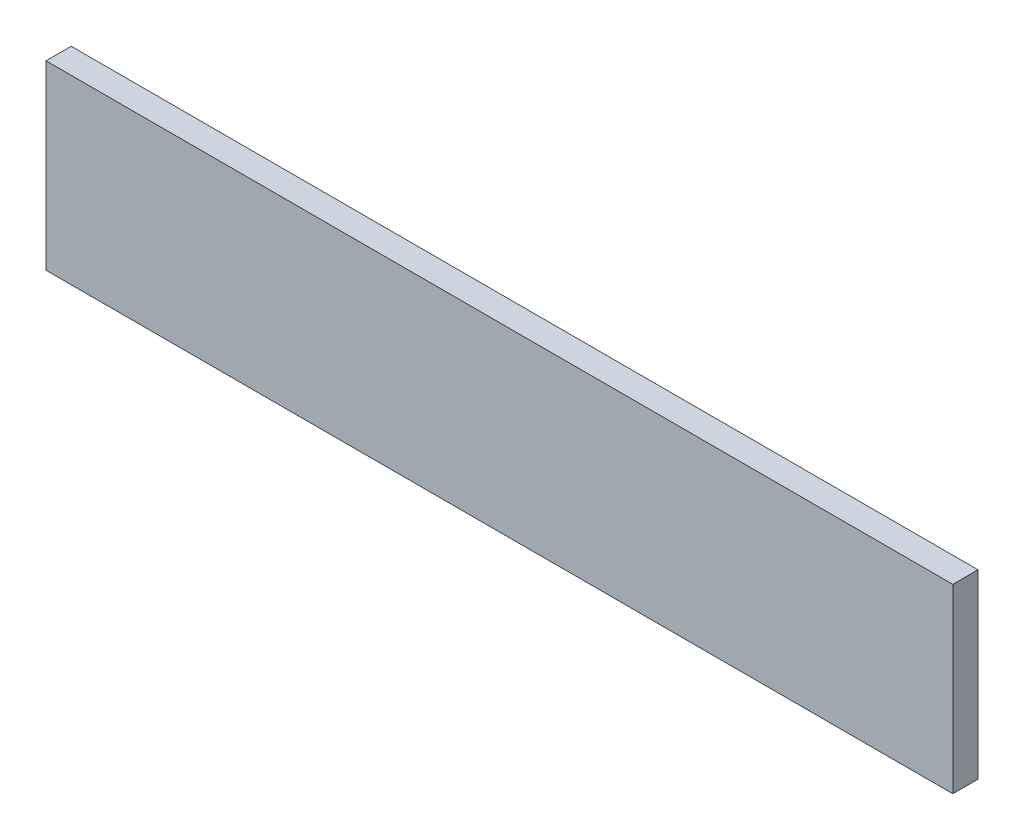
ISO-10303-21;
HEADER;
FILE_DESCRIPTION(('STEP AP214'),'2;1');
FILE_NAME('part.step','',(''),(''),'','','');
FILE_SCHEMA(('AUTOMOTIVE_DESIGN { 1 0 10303 214 1 1 1 1 }'));
ENDSEC;
DATA;
#1=APPLICATION_CONTEXT('core data for automotive mechanical design processes');
#2=APPLICATION_PROTOCOL_DEFINITION('international standard','automotive_design',2000,#1);
#3=PRODUCT_CONTEXT('',#1,'mechanical');
#4=PRODUCT('Part','Part','',(#3));
#5=PRODUCT_RELATED_PRODUCT_CATEGORY('part','',(#4));
#6=PRODUCT_DEFINITION_FORMATION('','',#4);
#7=PRODUCT_DEFINITION_CONTEXT('part definition',#1,'design');
#8=PRODUCT_DEFINITION('design','',#6,#7);
#9=PRODUCT_DEFINITION_SHAPE('','',#8);
#10=(LENGTH_UNIT() NAMED_UNIT(*) SI_UNIT(.MILLI.,.METRE.));
#11=(NAMED_UNIT(*) PLANE_ANGLE_UNIT() SI_UNIT($,.RADIAN.));
#12=(NAMED_UNIT(*) SI_UNIT($,.STERADIAN.) SOLID_ANGLE_UNIT());
#13=UNCERTAINTY_MEASURE_WITH_UNIT(LENGTH_MEASURE(1.E-05),#10,'distance_accuracy_value','');
#14=(GEOMETRIC_REPRESENTATION_CONTEXT(3) GLOBAL_UNCERTAINTY_ASSIGNED_CONTEXT((#13)) GLOBAL_UNIT_ASSIGNED_CONTEXT((#10,
#11,#12)) REPRESENTATION_CONTEXT('',''));
#15=CARTESIAN_POINT('',(0.,0.,0.));
#16=DIRECTION('',(0.,0.,1.));
#17=DIRECTION('',(1.,0.,0.));
#18=AXIS2_PLACEMENT_3D('',#15,#16,#17);
#19=CARTESIAN_POINT('',(57.15,-11.43,1.5875));
#20=DIRECTION('',(-1.,0.,0.));
#21=DIRECTION('',(0.,0.,1.));
#22=AXIS2_PLACEMENT_3D('',#19,#20,#21);
#23=PLANE('',#22);
#24=DIRECTION('',(0.,1.,0.));
#25=VECTOR('',#24,1.);
#26=CARTESIAN_POINT('',(57.15,-11.43,-1.5875));
#27=LINE('',#26,#25);
#28=CARTESIAN_POINT('',(57.15,-11.43,-1.5875));
#29=VERTEX_POINT('',#28);
#30=CARTESIAN_POINT('',(57.15,11.43,-1.5875));
#31=VERTEX_POINT('',#30);
#32=EDGE_CURVE('E107',#29,#31,#27,.T.);
#33=ORIENTED_EDGE('',*,*,#32,.T.);
#34=DIRECTION('',(0.,0.,-1.));
#35=VECTOR('',#34,1.);
#36=CARTESIAN_POINT('',(57.15,11.43,1.5875));
#37=LINE('',#36,#35);
#38=CARTESIAN_POINT('',(57.15,11.43,1.5875));
#39=VERTEX_POINT('',#38);
#40=EDGE_CURVE('E11',#39,#31,#37,.T.);
#41=ORIENTED_EDGE('',*,*,#40,.F.);
#42=DIRECTION('',(0.,1.,0.));
#43=VECTOR('',#42,1.);
#44=CARTESIAN_POINT('',(57.15,-11.43,1.5875));
#45=LINE('',#44,#43);
#46=CARTESIAN_POINT('',(57.15,-11.43,1.5875));
#47=VERTEX_POINT('',#46);
#48=EDGE_CURVE('E91',#47,#39,#45,.T.);
#49=ORIENTED_EDGE('',*,*,#48,.F.);
#50=DIRECTION('',(0.,0.,-1.));
#51=VECTOR('',#50,1.);
#52=CARTESIAN_POINT('',(57.15,-11.43,1.5875));
#53=LINE('',#52,#51);
#54=EDGE_CURVE('E103',#47,#29,#53,.T.);
#55=ORIENTED_EDGE('',*,*,#54,.T.);
#56=EDGE_LOOP('',(#33,#41,#49,#55));
#57=FACE_BOUND('',#56,.T.);
#58=ADVANCED_FACE('F39',(#57),#23,.F.);
#59=CARTESIAN_POINT('',(-57.15,11.43,1.5875));
#60=DIRECTION('',(0.,-1.,0.));
#61=DIRECTION('',(0.,0.,-1.));
#62=AXIS2_PLACEMENT_3D('',#59,#60,#61);
#63=PLANE('',#62);
#64=DIRECTION('',(-1.,0.,0.));
#65=VECTOR('',#64,1.);
#66=CARTESIAN_POINT('',(-57.15,11.43,-1.5875));
#67=LINE('',#66,#65);
#68=CARTESIAN_POINT('',(-57.15,11.43,-1.5875));
#69=VERTEX_POINT('',#68);
#70=EDGE_CURVE('E96',#31,#69,#67,.T.);
#71=ORIENTED_EDGE('',*,*,#70,.T.);
#72=DIRECTION('',(0.,0.,-1.));
#73=VECTOR('',#72,1.);
#74=CARTESIAN_POINT('',(-57.15,11.43,1.5875));
#75=LINE('',#74,#73);
#76=CARTESIAN_POINT('',(-57.15,11.43,1.5875));
#77=VERTEX_POINT('',#76);
#78=EDGE_CURVE('E48',#77,#69,#75,.T.);
#79=ORIENTED_EDGE('',*,*,#78,.F.);
#80=DIRECTION('',(-1.,0.,0.));
#81=VECTOR('',#80,1.);
#82=CARTESIAN_POINT('',(-57.15,11.43,1.5875));
#83=LINE('',#82,#81);
#84=EDGE_CURVE('E86',#39,#77,#83,.T.);
#85=ORIENTED_EDGE('',*,*,#84,.F.);
#86=ORIENTED_EDGE('',*,*,#40,.T.);
#87=EDGE_LOOP('',(#71,#79,#85,#86));
#88=FACE_BOUND('',#87,.T.);
#89=ADVANCED_FACE('F95',(#88),#63,.F.);
#90=CARTESIAN_POINT('',(-57.15,-11.43,1.5875));
#91=DIRECTION('',(1.,0.,0.));
#92=DIRECTION('',(0.,0.,-1.));
#93=AXIS2_PLACEMENT_3D('',#90,#91,#92);
#94=PLANE('',#93);
#95=DIRECTION('',(0.,-1.,0.));
#96=VECTOR('',#95,1.);
#97=CARTESIAN_POINT('',(-57.15,-11.43,-1.5875));
#98=LINE('',#97,#96);
#99=CARTESIAN_POINT('',(-57.15,-11.43,-1.5875));
#100=VERTEX_POINT('',#99);
#101=EDGE_CURVE('E73',#69,#100,#98,.T.);
#102=ORIENTED_EDGE('',*,*,#101,.T.);
#103=DIRECTION('',(0.,0.,-1.));
#104=VECTOR('',#103,1.);
#105=CARTESIAN_POINT('',(-57.15,-11.43,1.5875));
#106=LINE('',#105,#104);
#107=CARTESIAN_POINT('',(-57.15,-11.43,1.5875));
#108=VERTEX_POINT('',#107);
#109=EDGE_CURVE('E98',#108,#100,#106,.T.);
#110=ORIENTED_EDGE('',*,*,#109,.F.);
#111=DIRECTION('',(0.,-1.,0.));
#112=VECTOR('',#111,1.);
#113=CARTESIAN_POINT('',(-57.15,-11.43,1.5875));
#114=LINE('',#113,#112);
#115=EDGE_CURVE('E89',#77,#108,#114,.T.);
#116=ORIENTED_EDGE('',*,*,#115,.F.);
#117=ORIENTED_EDGE('',*,*,#78,.T.);
#118=EDGE_LOOP('',(#102,#110,#116,#117));
#119=FACE_BOUND('',#118,.T.);
#120=ADVANCED_FACE('F99',(#119),#94,.F.);
#121=CARTESIAN_POINT('',(-57.15,-11.43,1.5875));
#122=DIRECTION('',(0.,1.,0.));
#123=DIRECTION('',(0.,0.,1.));
#124=AXIS2_PLACEMENT_3D('',#121,#122,#123);
#125=PLANE('',#124);
#126=DIRECTION('',(1.,0.,0.));
#127=VECTOR('',#126,1.);
#128=CARTESIAN_POINT('',(-57.15,-11.43,-1.5875));
#129=LINE('',#128,#127);
#130=EDGE_CURVE('E79',#100,#29,#129,.T.);
#131=ORIENTED_EDGE('',*,*,#130,.T.);
#132=ORIENTED_EDGE('',*,*,#54,.F.);
#133=DIRECTION('',(1.,0.,0.));
#134=VECTOR('',#133,1.);
#135=CARTESIAN_POINT('',(-57.15,-11.43,1.5875));
#136=LINE('',#135,#134);
#137=EDGE_CURVE('E56',#108,#47,#136,.T.);
#138=ORIENTED_EDGE('',*,*,#137,.F.);
#139=ORIENTED_EDGE('',*,*,#109,.T.);
#140=EDGE_LOOP('',(#131,#132,#138,#139));
#141=FACE_BOUND('',#140,.T.);
#142=ADVANCED_FACE('F120',(#141),#125,.F.);
#143=CARTESIAN_POINT('',(0.,0.,1.5875));
#144=DIRECTION('',(0.,0.,-1.));
#145=DIRECTION('',(-1.,0.,0.));
#146=AXIS2_PLACEMENT_3D('',#143,#144,#145);
#147=PLANE('',#146);
#148=ORIENTED_EDGE('',*,*,#48,.T.);
#149=ORIENTED_EDGE('',*,*,#84,.T.);
#150=ORIENTED_EDGE('',*,*,#115,.T.);
#151=ORIENTED_EDGE('',*,*,#137,.T.);
#152=EDGE_LOOP('',(#148,#149,#150,#151));
#153=FACE_BOUND('',#152,.T.);
#154=ADVANCED_FACE('F87',(#153),#147,.F.);
#155=CARTESIAN_POINT('',(0.,0.,-1.5875));
#156=DIRECTION('',(0.,0.,-1.));
#157=DIRECTION('',(-1.,0.,0.));
#158=AXIS2_PLACEMENT_3D('',#155,#156,#157);
#159=PLANE('',#158);
#160=ORIENTED_EDGE('',*,*,#32,.F.);
#161=ORIENTED_EDGE('',*,*,#130,.F.);
#162=ORIENTED_EDGE('',*,*,#101,.F.);
#163=ORIENTED_EDGE('',*,*,#70,.F.);
#164=EDGE_LOOP('',(#160,#161,#162,#163));
#165=FACE_BOUND('',#164,.T.);
#166=ADVANCED_FACE('F123',(#165),#159,.T.);
#167=CLOSED_SHELL('',(#58,#89,#120,#142,#154,#166));
#168=MANIFOLD_SOLID_BREP('B2',#167);
#169=ADVANCED_BREP_SHAPE_REPRESENTATION('',(#18,#168),#14);
#170=SHAPE_DEFINITION_REPRESENTATION(#9,#169);
ENDSEC;
END-ISO-10303-21;
